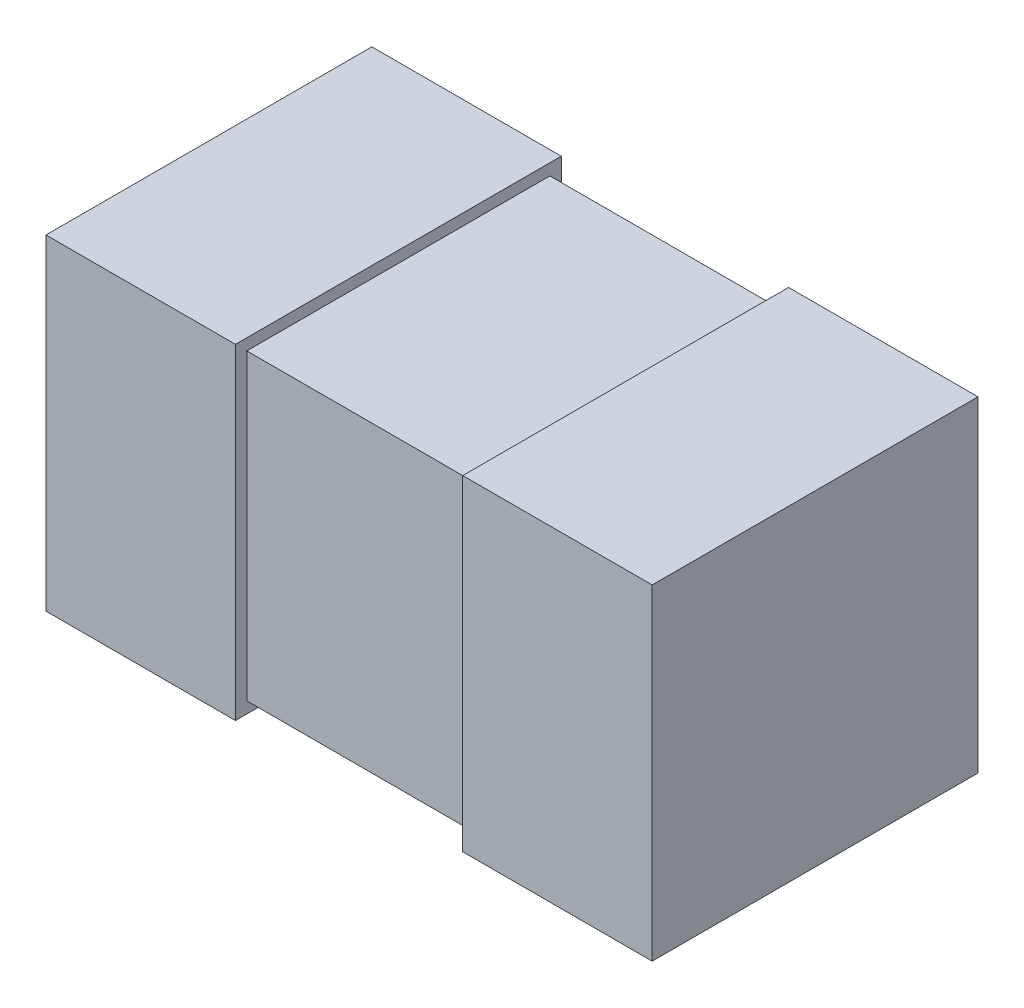
ISO-10303-21;
HEADER;
FILE_DESCRIPTION(('STEP AP214'),'2;1');
FILE_NAME('part.step','',(''),(''),'','','');
FILE_SCHEMA(('AUTOMOTIVE_DESIGN { 1 0 10303 214 1 1 1 1 }'));
ENDSEC;
DATA;
#1=APPLICATION_CONTEXT('core data for automotive mechanical design processes');
#2=APPLICATION_PROTOCOL_DEFINITION('international standard','automotive_design',2000,#1);
#3=PRODUCT_CONTEXT('',#1,'mechanical');
#4=PRODUCT('Part','Part','',(#3));
#5=PRODUCT_RELATED_PRODUCT_CATEGORY('part','',(#4));
#6=PRODUCT_DEFINITION_FORMATION('','',#4);
#7=PRODUCT_DEFINITION_CONTEXT('part definition',#1,'design');
#8=PRODUCT_DEFINITION('design','',#6,#7);
#9=PRODUCT_DEFINITION_SHAPE('','',#8);
#10=(LENGTH_UNIT() NAMED_UNIT(*) SI_UNIT(.MILLI.,.METRE.));
#11=(NAMED_UNIT(*) PLANE_ANGLE_UNIT() SI_UNIT($,.RADIAN.));
#12=(NAMED_UNIT(*) SI_UNIT($,.STERADIAN.) SOLID_ANGLE_UNIT());
#13=UNCERTAINTY_MEASURE_WITH_UNIT(LENGTH_MEASURE(1.E-05),#10,'distance_accuracy_value','');
#14=(GEOMETRIC_REPRESENTATION_CONTEXT(3) GLOBAL_UNCERTAINTY_ASSIGNED_CONTEXT((#13)) GLOBAL_UNIT_ASSIGNED_CONTEXT((#10,
#11,#12)) REPRESENTATION_CONTEXT('',''));
#15=CARTESIAN_POINT('',(0.,0.,0.));
#16=DIRECTION('',(0.,0.,1.));
#17=DIRECTION('',(1.,0.,0.));
#18=AXIS2_PLACEMENT_3D('',#15,#16,#17);
#19=CARTESIAN_POINT('',(-0.8,0.8,0.4));
#20=DIRECTION('',(0.,0.,-1.));
#21=DIRECTION('',(-1.,0.,0.));
#22=AXIS2_PLACEMENT_3D('',#19,#20,#21);
#23=PLANE('',#22);
#24=DIRECTION('',(0.,-1.,0.));
#25=VECTOR('',#24,1.);
#26=CARTESIAN_POINT('',(0.299999999999999,0.8,0.4));
#27=LINE('',#26,#25);
#28=CARTESIAN_POINT('',(0.299999999999999,0.8,0.4));
#29=VERTEX_POINT('',#28);
#30=CARTESIAN_POINT('',(0.299999999999999,0.,0.4));
#31=VERTEX_POINT('',#30);
#32=EDGE_CURVE('E53',#29,#31,#27,.T.);
#33=ORIENTED_EDGE('',*,*,#32,.F.);
#34=DIRECTION('',(1.,0.,0.));
#35=VECTOR('',#34,1.);
#36=CARTESIAN_POINT('',(-0.8,0.8,0.4));
#37=LINE('',#36,#35);
#38=CARTESIAN_POINT('',(-0.3,0.8,0.4));
#39=VERTEX_POINT('',#38);
#40=EDGE_CURVE('E218',#39,#29,#37,.T.);
#41=ORIENTED_EDGE('',*,*,#40,.F.);
#42=DIRECTION('',(0.,1.,0.));
#43=VECTOR('',#42,1.);
#44=CARTESIAN_POINT('',(-0.3,0.8,0.4));
#45=LINE('',#44,#43);
#46=CARTESIAN_POINT('',(-0.3,0.,0.4));
#47=VERTEX_POINT('',#46);
#48=EDGE_CURVE('E212',#47,#39,#45,.T.);
#49=ORIENTED_EDGE('',*,*,#48,.F.);
#50=DIRECTION('',(1.,0.,0.));
#51=VECTOR('',#50,1.);
#52=CARTESIAN_POINT('',(-0.8,0.,0.4));
#53=LINE('',#52,#51);
#54=EDGE_CURVE('E217',#47,#31,#53,.T.);
#55=ORIENTED_EDGE('',*,*,#54,.T.);
#56=EDGE_LOOP('',(#33,#41,#49,#55));
#57=FACE_BOUND('',#56,.T.);
#58=ADVANCED_FACE('F38',(#57),#23,.F.);
#59=CARTESIAN_POINT('',(-0.8,0.8,-0.4));
#60=DIRECTION('',(0.,0.,1.));
#61=DIRECTION('',(1.,0.,0.));
#62=AXIS2_PLACEMENT_3D('',#59,#60,#61);
#63=PLANE('',#62);
#64=DIRECTION('',(0.,1.,0.));
#65=VECTOR('',#64,1.);
#66=CARTESIAN_POINT('',(0.3,0.8,-0.4));
#67=LINE('',#66,#65);
#68=CARTESIAN_POINT('',(0.3,0.,-0.4));
#69=VERTEX_POINT('',#68);
#70=CARTESIAN_POINT('',(0.3,0.8,-0.4));
#71=VERTEX_POINT('',#70);
#72=EDGE_CURVE('E167',#69,#71,#67,.T.);
#73=ORIENTED_EDGE('',*,*,#72,.F.);
#74=DIRECTION('',(-1.,0.,0.));
#75=VECTOR('',#74,1.);
#76=CARTESIAN_POINT('',(-0.8,0.,-0.4));
#77=LINE('',#76,#75);
#78=CARTESIAN_POINT('',(-0.3,0.,-0.4));
#79=VERTEX_POINT('',#78);
#80=EDGE_CURVE('E221',#69,#79,#77,.T.);
#81=ORIENTED_EDGE('',*,*,#80,.T.);
#82=DIRECTION('',(0.,-1.,0.));
#83=VECTOR('',#82,1.);
#84=CARTESIAN_POINT('',(-0.3,0.8,-0.4));
#85=LINE('',#84,#83);
#86=CARTESIAN_POINT('',(-0.3,0.8,-0.4));
#87=VERTEX_POINT('',#86);
#88=EDGE_CURVE('E200',#87,#79,#85,.T.);
#89=ORIENTED_EDGE('',*,*,#88,.F.);
#90=DIRECTION('',(-1.,0.,0.));
#91=VECTOR('',#90,1.);
#92=CARTESIAN_POINT('',(-0.8,0.8,-0.4));
#93=LINE('',#92,#91);
#94=EDGE_CURVE('E220',#71,#87,#93,.T.);
#95=ORIENTED_EDGE('',*,*,#94,.F.);
#96=EDGE_LOOP('',(#73,#81,#89,#95));
#97=FACE_BOUND('',#96,.T.);
#98=ADVANCED_FACE('F238',(#97),#63,.F.);
#99=CARTESIAN_POINT('',(-0.8,0.8,0.4));
#100=DIRECTION('',(0.,1.,0.));
#101=DIRECTION('',(0.,0.,1.));
#102=AXIS2_PLACEMENT_3D('',#99,#100,#101);
#103=PLANE('',#102);
#104=ORIENTED_EDGE('',*,*,#40,.T.);
#105=DIRECTION('',(0.,0.,-1.));
#106=VECTOR('',#105,1.);
#107=CARTESIAN_POINT('',(0.3,0.8,0.4));
#108=LINE('',#107,#106);
#109=EDGE_CURVE('E60',#29,#71,#108,.T.);
#110=ORIENTED_EDGE('',*,*,#109,.T.);
#111=ORIENTED_EDGE('',*,*,#94,.T.);
#112=DIRECTION('',(0.,0.,1.));
#113=VECTOR('',#112,1.);
#114=CARTESIAN_POINT('',(-0.3,0.8,0.4));
#115=LINE('',#114,#113);
#116=EDGE_CURVE('E215',#87,#39,#115,.T.);
#117=ORIENTED_EDGE('',*,*,#116,.T.);
#118=EDGE_LOOP('',(#104,#110,#111,#117));
#119=FACE_BOUND('',#118,.T.);
#120=ADVANCED_FACE('F235',(#119),#103,.T.);
#121=CARTESIAN_POINT('',(-0.8,0.,0.4));
#122=DIRECTION('',(0.,1.,0.));
#123=DIRECTION('',(0.,0.,1.));
#124=AXIS2_PLACEMENT_3D('',#121,#122,#123);
#125=PLANE('',#124);
#126=DIRECTION('',(0.,0.,-1.));
#127=VECTOR('',#126,1.);
#128=CARTESIAN_POINT('',(0.3,0.,0.4));
#129=LINE('',#128,#127);
#130=EDGE_CURVE('E12',#31,#69,#129,.T.);
#131=ORIENTED_EDGE('',*,*,#130,.F.);
#132=ORIENTED_EDGE('',*,*,#54,.F.);
#133=DIRECTION('',(0.,0.,1.));
#134=VECTOR('',#133,1.);
#135=CARTESIAN_POINT('',(-0.3,0.,0.4));
#136=LINE('',#135,#134);
#137=EDGE_CURVE('E46',#79,#47,#136,.T.);
#138=ORIENTED_EDGE('',*,*,#137,.F.);
#139=ORIENTED_EDGE('',*,*,#80,.F.);
#140=EDGE_LOOP('',(#131,#132,#138,#139));
#141=FACE_BOUND('',#140,.T.);
#142=ADVANCED_FACE('F233',(#141),#125,.F.);
#143=CARTESIAN_POINT('',(-0.3,-0.03,1.45478640923567));
#144=DIRECTION('',(0.,1.,0.));
#145=DIRECTION('',(-1.,0.,0.));
#146=AXIS2_PLACEMENT_3D('',#143,#144,#145);
#147=PLANE('',#146);
#148=DIRECTION('',(0.,0.,-1.));
#149=VECTOR('',#148,1.);
#150=CARTESIAN_POINT('',(-0.3,-0.03,1.45478640923567));
#151=LINE('',#150,#149);
#152=CARTESIAN_POINT('',(-0.3,-0.03,0.43));
#153=VERTEX_POINT('',#152);
#154=CARTESIAN_POINT('',(-0.3,-0.03,-0.43));
#155=VERTEX_POINT('',#154);
#156=EDGE_CURVE('E189',#153,#155,#151,.T.);
#157=ORIENTED_EDGE('',*,*,#156,.F.);
#158=DIRECTION('',(-1.,0.,0.));
#159=VECTOR('',#158,1.);
#160=CARTESIAN_POINT('',(-0.3,-0.03,0.43));
#161=LINE('',#160,#159);
#162=CARTESIAN_POINT('',(-0.8,-0.03,0.43));
#163=VERTEX_POINT('',#162);
#164=EDGE_CURVE('E194',#153,#163,#161,.T.);
#165=ORIENTED_EDGE('',*,*,#164,.T.);
#166=DIRECTION('',(0.,0.,-1.));
#167=VECTOR('',#166,1.);
#168=CARTESIAN_POINT('',(-0.8,-0.03,1.45478640923567));
#169=LINE('',#168,#167);
#170=CARTESIAN_POINT('',(-0.8,-0.03,-0.43));
#171=VERTEX_POINT('',#170);
#172=EDGE_CURVE('E202',#163,#171,#169,.T.);
#173=ORIENTED_EDGE('',*,*,#172,.T.);
#174=DIRECTION('',(-1.,0.,0.));
#175=VECTOR('',#174,1.);
#176=CARTESIAN_POINT('',(-0.3,-0.03,-0.43));
#177=LINE('',#176,#175);
#178=EDGE_CURVE('E180',#155,#171,#177,.T.);
#179=ORIENTED_EDGE('',*,*,#178,.F.);
#180=EDGE_LOOP('',(#157,#165,#173,#179));
#181=FACE_BOUND('',#180,.T.);
#182=ADVANCED_FACE('F279',(#181),#147,.F.);
#183=CARTESIAN_POINT('',(-0.3,0.83,1.45478640923567));
#184=DIRECTION('',(0.,-1.,0.));
#185=DIRECTION('',(1.,0.,0.));
#186=AXIS2_PLACEMENT_3D('',#183,#184,#185);
#187=PLANE('',#186);
#188=DIRECTION('',(0.,0.,-1.));
#189=VECTOR('',#188,1.);
#190=CARTESIAN_POINT('',(-0.8,0.83,1.45478640923567));
#191=LINE('',#190,#189);
#192=CARTESIAN_POINT('',(-0.8,0.83,0.43));
#193=VERTEX_POINT('',#192);
#194=CARTESIAN_POINT('',(-0.8,0.83,-0.43));
#195=VERTEX_POINT('',#194);
#196=EDGE_CURVE('E204',#193,#195,#191,.T.);
#197=ORIENTED_EDGE('',*,*,#196,.F.);
#198=DIRECTION('',(1.,0.,0.));
#199=VECTOR('',#198,1.);
#200=CARTESIAN_POINT('',(-0.3,0.83,0.43));
#201=LINE('',#200,#199);
#202=CARTESIAN_POINT('',(-0.3,0.83,0.43));
#203=VERTEX_POINT('',#202);
#204=EDGE_CURVE('E193',#193,#203,#201,.T.);
#205=ORIENTED_EDGE('',*,*,#204,.T.);
#206=DIRECTION('',(0.,0.,-1.));
#207=VECTOR('',#206,1.);
#208=CARTESIAN_POINT('',(-0.3,0.83,1.45478640923567));
#209=LINE('',#208,#207);
#210=CARTESIAN_POINT('',(-0.3,0.83,-0.43));
#211=VERTEX_POINT('',#210);
#212=EDGE_CURVE('E206',#203,#211,#209,.T.);
#213=ORIENTED_EDGE('',*,*,#212,.T.);
#214=DIRECTION('',(1.,0.,0.));
#215=VECTOR('',#214,1.);
#216=CARTESIAN_POINT('',(-0.3,0.83,-0.43));
#217=LINE('',#216,#215);
#218=EDGE_CURVE('E186',#195,#211,#217,.T.);
#219=ORIENTED_EDGE('',*,*,#218,.F.);
#220=EDGE_LOOP('',(#197,#205,#213,#219));
#221=FACE_BOUND('',#220,.T.);
#222=ADVANCED_FACE('F282',(#221),#187,.F.);
#223=CARTESIAN_POINT('',(-0.3,0.83,1.45478640923567));
#224=DIRECTION('',(-1.,0.,0.));
#225=DIRECTION('',(0.,-1.,0.));
#226=AXIS2_PLACEMENT_3D('',#223,#224,#225);
#227=PLANE('',#226);
#228=ORIENTED_EDGE('',*,*,#116,.F.);
#229=ORIENTED_EDGE('',*,*,#88,.T.);
#230=ORIENTED_EDGE('',*,*,#137,.T.);
#231=ORIENTED_EDGE('',*,*,#48,.T.);
#232=EDGE_LOOP('',(#228,#229,#230,#231));
#233=FACE_BOUND('',#232,.T.);
#234=ORIENTED_EDGE('',*,*,#212,.F.);
#235=DIRECTION('',(0.,-1.,0.));
#236=VECTOR('',#235,1.);
#237=CARTESIAN_POINT('',(-0.3,0.83,0.43));
#238=LINE('',#237,#236);
#239=EDGE_CURVE('E197',#203,#153,#238,.T.);
#240=ORIENTED_EDGE('',*,*,#239,.T.);
#241=ORIENTED_EDGE('',*,*,#156,.T.);
#242=DIRECTION('',(0.,-1.,0.));
#243=VECTOR('',#242,1.);
#244=CARTESIAN_POINT('',(-0.3,0.83,-0.43));
#245=LINE('',#244,#243);
#246=EDGE_CURVE('E183',#211,#155,#245,.T.);
#247=ORIENTED_EDGE('',*,*,#246,.F.);
#248=EDGE_LOOP('',(#234,#240,#241,#247));
#249=FACE_BOUND('',#248,.T.);
#250=ADVANCED_FACE('F228',(#233,#249),#227,.F.);
#251=CARTESIAN_POINT('',(-0.8,0.8,0.43));
#252=DIRECTION('',(0.,0.,-1.));
#253=DIRECTION('',(-1.,0.,0.));
#254=AXIS2_PLACEMENT_3D('',#251,#252,#253);
#255=PLANE('',#254);
#256=ORIENTED_EDGE('',*,*,#204,.F.);
#257=DIRECTION('',(0.,1.,0.));
#258=VECTOR('',#257,1.);
#259=CARTESIAN_POINT('',(-0.8,0.83,0.43));
#260=LINE('',#259,#258);
#261=EDGE_CURVE('E190',#163,#193,#260,.T.);
#262=ORIENTED_EDGE('',*,*,#261,.F.);
#263=ORIENTED_EDGE('',*,*,#164,.F.);
#264=ORIENTED_EDGE('',*,*,#239,.F.);
#265=EDGE_LOOP('',(#256,#262,#263,#264));
#266=FACE_BOUND('',#265,.T.);
#267=ADVANCED_FACE('F274',(#266),#255,.F.);
#268=CARTESIAN_POINT('',(-0.8,0.8,-0.43));
#269=DIRECTION('',(0.,0.,1.));
#270=DIRECTION('',(1.,0.,0.));
#271=AXIS2_PLACEMENT_3D('',#268,#269,#270);
#272=PLANE('',#271);
#273=ORIENTED_EDGE('',*,*,#246,.T.);
#274=ORIENTED_EDGE('',*,*,#178,.T.);
#275=DIRECTION('',(0.,1.,0.));
#276=VECTOR('',#275,1.);
#277=CARTESIAN_POINT('',(-0.8,0.83,-0.43));
#278=LINE('',#277,#276);
#279=EDGE_CURVE('E177',#171,#195,#278,.T.);
#280=ORIENTED_EDGE('',*,*,#279,.T.);
#281=ORIENTED_EDGE('',*,*,#218,.T.);
#282=EDGE_LOOP('',(#273,#274,#280,#281));
#283=FACE_BOUND('',#282,.T.);
#284=ADVANCED_FACE('F271',(#283),#272,.F.);
#285=CARTESIAN_POINT('',(-0.8,0.8,-0.4));
#286=DIRECTION('',(1.,0.,0.));
#287=DIRECTION('',(0.,0.,-1.));
#288=AXIS2_PLACEMENT_3D('',#285,#286,#287);
#289=PLANE('',#288);
#290=ORIENTED_EDGE('',*,*,#172,.F.);
#291=ORIENTED_EDGE('',*,*,#261,.T.);
#292=ORIENTED_EDGE('',*,*,#196,.T.);
#293=ORIENTED_EDGE('',*,*,#279,.F.);
#294=EDGE_LOOP('',(#290,#291,#292,#293));
#295=FACE_BOUND('',#294,.T.);
#296=ADVANCED_FACE('F40',(#295),#289,.F.);
#297=CARTESIAN_POINT('',(0.3,-0.0299999999999999,1.45478640923567));
#298=DIRECTION('',(0.,1.,0.));
#299=DIRECTION('',(-1.,0.,0.));
#300=AXIS2_PLACEMENT_3D('',#297,#298,#299);
#301=PLANE('',#300);
#302=DIRECTION('',(0.,0.,-1.));
#303=VECTOR('',#302,1.);
#304=CARTESIAN_POINT('',(0.8,-0.0299999999999998,1.45478640923567));
#305=LINE('',#304,#303);
#306=CARTESIAN_POINT('',(0.8,-0.0299999999999998,0.43));
#307=VERTEX_POINT('',#306);
#308=CARTESIAN_POINT('',(0.8,-0.0299999999999998,-0.43));
#309=VERTEX_POINT('',#308);
#310=EDGE_CURVE('E140',#307,#309,#305,.T.);
#311=ORIENTED_EDGE('',*,*,#310,.F.);
#312=DIRECTION('',(-1.,0.,0.));
#313=VECTOR('',#312,1.);
#314=CARTESIAN_POINT('',(0.3,-0.0299999999999999,0.43));
#315=LINE('',#314,#313);
#316=CARTESIAN_POINT('',(0.3,-0.0299999999999999,0.43));
#317=VERTEX_POINT('',#316);
#318=EDGE_CURVE('E135',#307,#317,#315,.T.);
#319=ORIENTED_EDGE('',*,*,#318,.T.);
#320=DIRECTION('',(0.,0.,-1.));
#321=VECTOR('',#320,1.);
#322=CARTESIAN_POINT('',(0.3,-0.0299999999999999,1.45478640923567));
#323=LINE('',#322,#321);
#324=CARTESIAN_POINT('',(0.3,-0.0299999999999999,-0.43));
#325=VERTEX_POINT('',#324);
#326=EDGE_CURVE('E130',#317,#325,#323,.T.);
#327=ORIENTED_EDGE('',*,*,#326,.T.);
#328=DIRECTION('',(-1.,0.,0.));
#329=VECTOR('',#328,1.);
#330=CARTESIAN_POINT('',(0.3,-0.0299999999999999,-0.43));
#331=LINE('',#330,#329);
#332=EDGE_CURVE('E134',#309,#325,#331,.T.);
#333=ORIENTED_EDGE('',*,*,#332,.F.);
#334=EDGE_LOOP('',(#311,#319,#327,#333));
#335=FACE_BOUND('',#334,.T.);
#336=ADVANCED_FACE('F133',(#335),#301,.F.);
#337=CARTESIAN_POINT('',(0.3,0.83,1.45478640923567));
#338=DIRECTION('',(1.,0.,0.));
#339=DIRECTION('',(0.,0.,-1.));
#340=AXIS2_PLACEMENT_3D('',#337,#338,#339);
#341=PLANE('',#340);
#342=ORIENTED_EDGE('',*,*,#109,.F.);
#343=ORIENTED_EDGE('',*,*,#32,.T.);
#344=ORIENTED_EDGE('',*,*,#130,.T.);
#345=ORIENTED_EDGE('',*,*,#72,.T.);
#346=EDGE_LOOP('',(#342,#343,#344,#345));
#347=FACE_BOUND('',#346,.T.);
#348=ORIENTED_EDGE('',*,*,#326,.F.);
#349=DIRECTION('',(0.,1.,0.));
#350=VECTOR('',#349,1.);
#351=CARTESIAN_POINT('',(0.3,0.83,0.43));
#352=LINE('',#351,#350);
#353=CARTESIAN_POINT('',(0.3,0.83,0.43));
#354=VERTEX_POINT('',#353);
#355=EDGE_CURVE('E162',#317,#354,#352,.T.);
#356=ORIENTED_EDGE('',*,*,#355,.T.);
#357=DIRECTION('',(0.,0.,-1.));
#358=VECTOR('',#357,1.);
#359=CARTESIAN_POINT('',(0.3,0.83,1.45478640923567));
#360=LINE('',#359,#358);
#361=CARTESIAN_POINT('',(0.3,0.83,-0.43));
#362=VERTEX_POINT('',#361);
#363=EDGE_CURVE('E139',#354,#362,#360,.T.);
#364=ORIENTED_EDGE('',*,*,#363,.T.);
#365=DIRECTION('',(0.,1.,0.));
#366=VECTOR('',#365,1.);
#367=CARTESIAN_POINT('',(0.3,0.83,-0.43));
#368=LINE('',#367,#366);
#369=EDGE_CURVE('E147',#325,#362,#368,.T.);
#370=ORIENTED_EDGE('',*,*,#369,.F.);
#371=EDGE_LOOP('',(#348,#356,#364,#370));
#372=FACE_BOUND('',#371,.T.);
#373=ADVANCED_FACE('F152',(#347,#372),#341,.F.);
#374=CARTESIAN_POINT('',(0.3,0.83,1.45478640923567));
#375=DIRECTION('',(0.,-1.,0.));
#376=DIRECTION('',(0.,0.,-1.));
#377=AXIS2_PLACEMENT_3D('',#374,#375,#376);
#378=PLANE('',#377);
#379=ORIENTED_EDGE('',*,*,#363,.F.);
#380=DIRECTION('',(1.,0.,0.));
#381=VECTOR('',#380,1.);
#382=CARTESIAN_POINT('',(0.3,0.83,0.43));
#383=LINE('',#382,#381);
#384=CARTESIAN_POINT('',(0.8,0.83,0.43));
#385=VERTEX_POINT('',#384);
#386=EDGE_CURVE('E165',#354,#385,#383,.T.);
#387=ORIENTED_EDGE('',*,*,#386,.T.);
#388=DIRECTION('',(0.,0.,-1.));
#389=VECTOR('',#388,1.);
#390=CARTESIAN_POINT('',(0.8,0.83,1.45478640923567));
#391=LINE('',#390,#389);
#392=CARTESIAN_POINT('',(0.8,0.83,-0.43));
#393=VERTEX_POINT('',#392);
#394=EDGE_CURVE('E154',#385,#393,#391,.T.);
#395=ORIENTED_EDGE('',*,*,#394,.T.);
#396=DIRECTION('',(1.,0.,0.));
#397=VECTOR('',#396,1.);
#398=CARTESIAN_POINT('',(0.3,0.83,-0.43));
#399=LINE('',#398,#397);
#400=EDGE_CURVE('E155',#362,#393,#399,.T.);
#401=ORIENTED_EDGE('',*,*,#400,.F.);
#402=EDGE_LOOP('',(#379,#387,#395,#401));
#403=FACE_BOUND('',#402,.T.);
#404=ADVANCED_FACE('F258',(#403),#378,.F.);
#405=CARTESIAN_POINT('',(-0.8,0.8,0.43));
#406=DIRECTION('',(0.,0.,-1.));
#407=DIRECTION('',(-1.,0.,0.));
#408=AXIS2_PLACEMENT_3D('',#405,#406,#407);
#409=PLANE('',#408);
#410=ORIENTED_EDGE('',*,*,#355,.F.);
#411=ORIENTED_EDGE('',*,*,#318,.F.);
#412=DIRECTION('',(0.,-1.,0.));
#413=VECTOR('',#412,1.);
#414=CARTESIAN_POINT('',(0.8,0.83,0.43));
#415=LINE('',#414,#413);
#416=EDGE_CURVE('E163',#385,#307,#415,.T.);
#417=ORIENTED_EDGE('',*,*,#416,.F.);
#418=ORIENTED_EDGE('',*,*,#386,.F.);
#419=EDGE_LOOP('',(#410,#411,#417,#418));
#420=FACE_BOUND('',#419,.T.);
#421=ADVANCED_FACE('F254',(#420),#409,.F.);
#422=CARTESIAN_POINT('',(-0.8,0.8,-0.43));
#423=DIRECTION('',(0.,0.,1.));
#424=DIRECTION('',(1.,0.,0.));
#425=AXIS2_PLACEMENT_3D('',#422,#423,#424);
#426=PLANE('',#425);
#427=ORIENTED_EDGE('',*,*,#400,.T.);
#428=DIRECTION('',(0.,-1.,0.));
#429=VECTOR('',#428,1.);
#430=CARTESIAN_POINT('',(0.8,0.83,-0.43));
#431=LINE('',#430,#429);
#432=EDGE_CURVE('E150',#393,#309,#431,.T.);
#433=ORIENTED_EDGE('',*,*,#432,.T.);
#434=ORIENTED_EDGE('',*,*,#332,.T.);
#435=ORIENTED_EDGE('',*,*,#369,.T.);
#436=EDGE_LOOP('',(#427,#433,#434,#435));
#437=FACE_BOUND('',#436,.T.);
#438=ADVANCED_FACE('F146',(#437),#426,.F.);
#439=CARTESIAN_POINT('',(0.8,0.8,-0.4));
#440=DIRECTION('',(-1.,0.,0.));
#441=DIRECTION('',(0.,0.,1.));
#442=AXIS2_PLACEMENT_3D('',#439,#440,#441);
#443=PLANE('',#442);
#444=ORIENTED_EDGE('',*,*,#394,.F.);
#445=ORIENTED_EDGE('',*,*,#416,.T.);
#446=ORIENTED_EDGE('',*,*,#310,.T.);
#447=ORIENTED_EDGE('',*,*,#432,.F.);
#448=EDGE_LOOP('',(#444,#445,#446,#447));
#449=FACE_BOUND('',#448,.T.);
#450=ADVANCED_FACE('F248',(#449),#443,.F.);
#451=CLOSED_SHELL('',(#58,#98,#120,#142,#182,#222,#250,#267,#284,#296,#336,#373,#404,#421,#438,#450));
#452=MANIFOLD_SOLID_BREP('B2',#451);
#453=ADVANCED_BREP_SHAPE_REPRESENTATION('',(#18,#452),#14);
#454=SHAPE_DEFINITION_REPRESENTATION(#9,#453);
ENDSEC;
END-ISO-10303-21;
